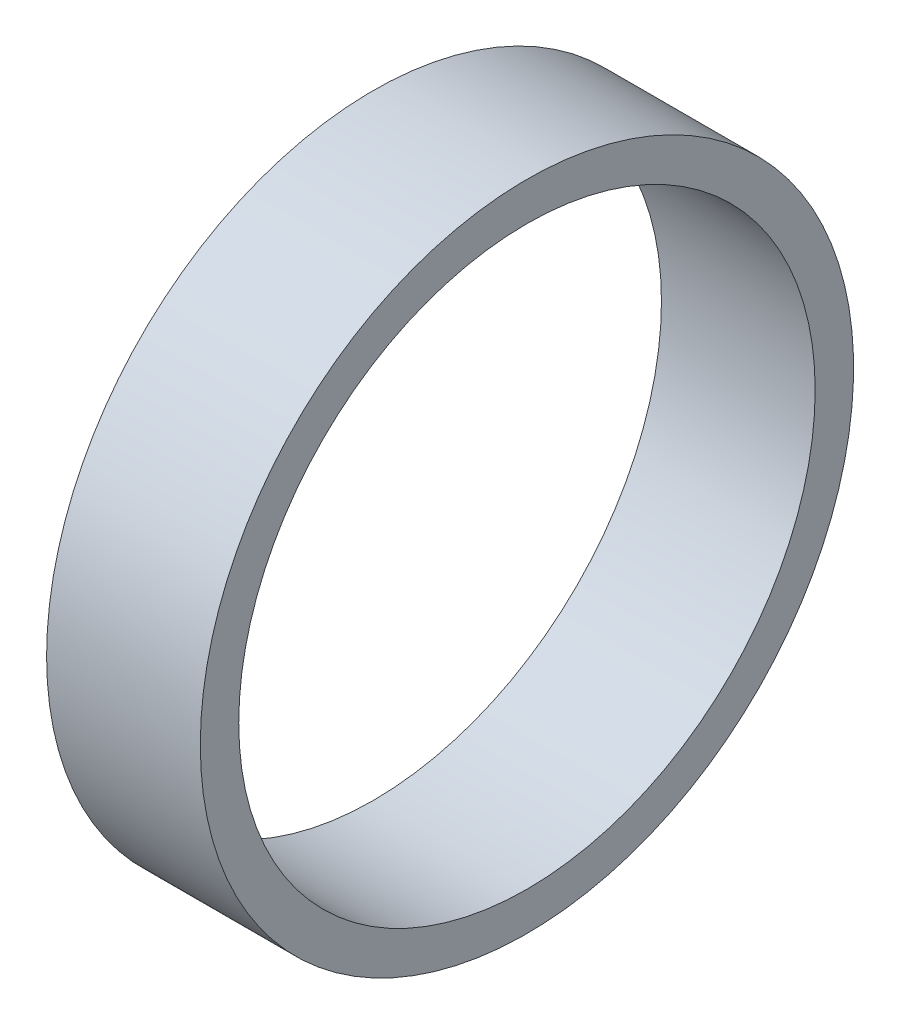
ISO-10303-21;
HEADER;
FILE_DESCRIPTION(('STEP AP214'),'2;1');
FILE_NAME('part.step','',(''),(''),'','','');
FILE_SCHEMA(('AUTOMOTIVE_DESIGN { 1 0 10303 214 1 1 1 1 }'));
ENDSEC;
DATA;
#1=APPLICATION_CONTEXT('core data for automotive mechanical design processes');
#2=APPLICATION_PROTOCOL_DEFINITION('international standard','automotive_design',2000,#1);
#3=PRODUCT_CONTEXT('',#1,'mechanical');
#4=PRODUCT('Part','Part','',(#3));
#5=PRODUCT_RELATED_PRODUCT_CATEGORY('part','',(#4));
#6=PRODUCT_DEFINITION_FORMATION('','',#4);
#7=PRODUCT_DEFINITION_CONTEXT('part definition',#1,'design');
#8=PRODUCT_DEFINITION('design','',#6,#7);
#9=PRODUCT_DEFINITION_SHAPE('','',#8);
#10=(LENGTH_UNIT() NAMED_UNIT(*) SI_UNIT(.MILLI.,.METRE.));
#11=(NAMED_UNIT(*) PLANE_ANGLE_UNIT() SI_UNIT($,.RADIAN.));
#12=(NAMED_UNIT(*) SI_UNIT($,.STERADIAN.) SOLID_ANGLE_UNIT());
#13=UNCERTAINTY_MEASURE_WITH_UNIT(LENGTH_MEASURE(1.E-05),#10,'distance_accuracy_value','');
#14=(GEOMETRIC_REPRESENTATION_CONTEXT(3) GLOBAL_UNCERTAINTY_ASSIGNED_CONTEXT((#13)) GLOBAL_UNIT_ASSIGNED_CONTEXT((#10,
#11,#12)) REPRESENTATION_CONTEXT('',''));
#15=CARTESIAN_POINT('',(0.,0.,0.));
#16=DIRECTION('',(0.,0.,1.));
#17=DIRECTION('',(1.,0.,0.));
#18=AXIS2_PLACEMENT_3D('',#15,#16,#17);
#19=CARTESIAN_POINT('',(0.,7.5,0.));
#20=DIRECTION('',(1.,0.,0.));
#21=DIRECTION('',(0.,0.,-1.));
#22=AXIS2_PLACEMENT_3D('',#19,#20,#21);
#23=PLANE('',#22);
#24=CARTESIAN_POINT('',(0.,0.,0.));
#25=DIRECTION('',(-1.,0.,0.));
#26=DIRECTION('',(0.,0.,1.));
#27=AXIS2_PLACEMENT_3D('',#24,#25,#26);
#28=CIRCLE('',#27,7.5);
#29=CARTESIAN_POINT('',(0.,0.,7.5));
#30=VERTEX_POINT('',#29);
#31=EDGE_CURVE('E28',#30,#30,#28,.T.);
#32=ORIENTED_EDGE('',*,*,#31,.F.);
#33=EDGE_LOOP('',(#32));
#34=FACE_BOUND('',#33,.T.);
#35=CARTESIAN_POINT('',(0.,0.,0.));
#36=DIRECTION('',(-1.,0.,0.));
#37=DIRECTION('',(0.,0.,1.));
#38=AXIS2_PLACEMENT_3D('',#35,#36,#37);
#39=CIRCLE('',#38,8.5);
#40=CARTESIAN_POINT('',(0.,0.,8.5));
#41=VERTEX_POINT('',#40);
#42=EDGE_CURVE('E10',#41,#41,#39,.T.);
#43=ORIENTED_EDGE('',*,*,#42,.T.);
#44=EDGE_LOOP('',(#43));
#45=FACE_BOUND('',#44,.T.);
#46=ADVANCED_FACE('F14',(#34,#45),#23,.F.);
#47=CARTESIAN_POINT('',(0.,0.,0.));
#48=DIRECTION('',(-1.,0.,0.));
#49=DIRECTION('',(0.,0.,1.));
#50=AXIS2_PLACEMENT_3D('',#47,#48,#49);
#51=CYLINDRICAL_SURFACE('',#50,8.5);
#52=ORIENTED_EDGE('',*,*,#42,.F.);
#53=EDGE_LOOP('',(#52));
#54=FACE_BOUND('',#53,.T.);
#55=CARTESIAN_POINT('',(4.,0.,0.));
#56=DIRECTION('',(-1.,0.,0.));
#57=DIRECTION('',(0.,0.,1.));
#58=AXIS2_PLACEMENT_3D('',#55,#56,#57);
#59=CIRCLE('',#58,8.5);
#60=CARTESIAN_POINT('',(4.,0.,8.5));
#61=VERTEX_POINT('',#60);
#62=EDGE_CURVE('E20',#61,#61,#59,.T.);
#63=ORIENTED_EDGE('',*,*,#62,.T.);
#64=EDGE_LOOP('',(#63));
#65=FACE_BOUND('',#64,.T.);
#66=ADVANCED_FACE('F37',(#54,#65),#51,.T.);
#67=CARTESIAN_POINT('',(4.,7.5,0.));
#68=DIRECTION('',(-1.,0.,0.));
#69=DIRECTION('',(0.,0.,1.));
#70=AXIS2_PLACEMENT_3D('',#67,#68,#69);
#71=PLANE('',#70);
#72=ORIENTED_EDGE('',*,*,#62,.F.);
#73=EDGE_LOOP('',(#72));
#74=FACE_BOUND('',#73,.T.);
#75=CARTESIAN_POINT('',(4.,0.,0.));
#76=DIRECTION('',(-1.,0.,0.));
#77=DIRECTION('',(0.,0.,1.));
#78=AXIS2_PLACEMENT_3D('',#75,#76,#77);
#79=CIRCLE('',#78,7.5);
#80=CARTESIAN_POINT('',(4.,0.,7.5));
#81=VERTEX_POINT('',#80);
#82=EDGE_CURVE('E24',#81,#81,#79,.T.);
#83=ORIENTED_EDGE('',*,*,#82,.T.);
#84=EDGE_LOOP('',(#83));
#85=FACE_BOUND('',#84,.T.);
#86=ADVANCED_FACE('F43',(#74,#85),#71,.F.);
#87=CARTESIAN_POINT('',(0.,0.,0.));
#88=DIRECTION('',(-1.,0.,0.));
#89=DIRECTION('',(0.,0.,1.));
#90=AXIS2_PLACEMENT_3D('',#87,#88,#89);
#91=CYLINDRICAL_SURFACE('',#90,7.5);
#92=ORIENTED_EDGE('',*,*,#82,.F.);
#93=EDGE_LOOP('',(#92));
#94=FACE_BOUND('',#93,.T.);
#95=ORIENTED_EDGE('',*,*,#31,.T.);
#96=EDGE_LOOP('',(#95));
#97=FACE_BOUND('',#96,.T.);
#98=ADVANCED_FACE('F34',(#94,#97),#91,.F.);
#99=CLOSED_SHELL('',(#46,#66,#86,#98));
#100=MANIFOLD_SOLID_BREP('B1',#99);
#101=ADVANCED_BREP_SHAPE_REPRESENTATION('',(#18,#100),#14);
#102=SHAPE_DEFINITION_REPRESENTATION(#9,#101);
ENDSEC;
END-ISO-10303-21;
